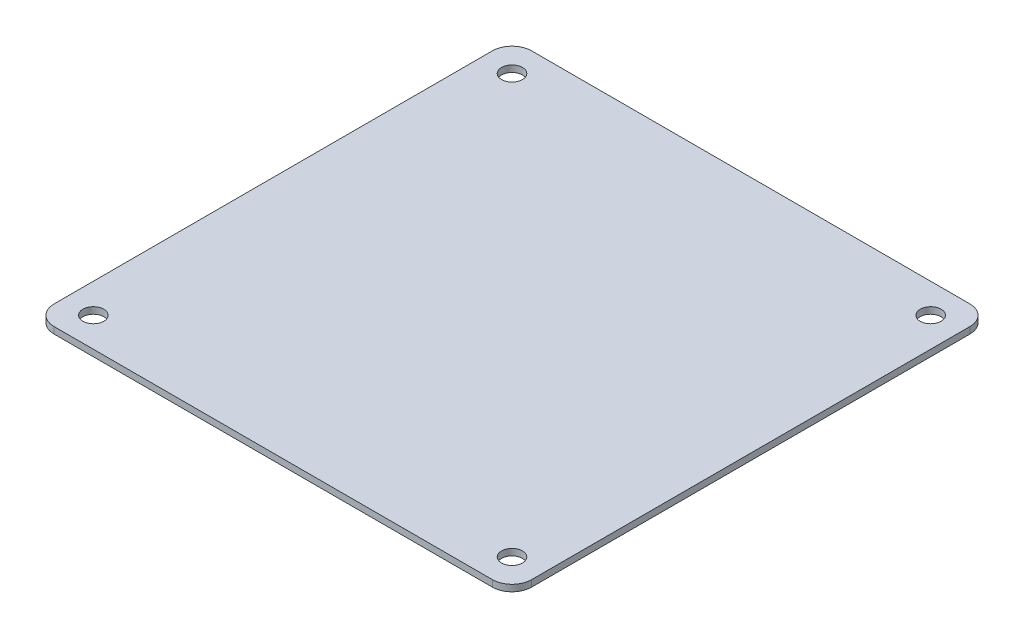
ISO-10303-21;
HEADER;
FILE_DESCRIPTION(('STEP AP214'),'2;1');
FILE_NAME('part.step','',(''),(''),'','','');
FILE_SCHEMA(('AUTOMOTIVE_DESIGN { 1 0 10303 214 1 1 1 1 }'));
ENDSEC;
DATA;
#1=APPLICATION_CONTEXT('core data for automotive mechanical design processes');
#2=APPLICATION_PROTOCOL_DEFINITION('international standard','automotive_design',2000,#1);
#3=PRODUCT_CONTEXT('',#1,'mechanical');
#4=PRODUCT('Part','Part','',(#3));
#5=PRODUCT_RELATED_PRODUCT_CATEGORY('part','',(#4));
#6=PRODUCT_DEFINITION_FORMATION('','',#4);
#7=PRODUCT_DEFINITION_CONTEXT('part definition',#1,'design');
#8=PRODUCT_DEFINITION('design','',#6,#7);
#9=PRODUCT_DEFINITION_SHAPE('','',#8);
#10=(LENGTH_UNIT() NAMED_UNIT(*) SI_UNIT(.MILLI.,.METRE.));
#11=(NAMED_UNIT(*) PLANE_ANGLE_UNIT() SI_UNIT($,.RADIAN.));
#12=(NAMED_UNIT(*) SI_UNIT($,.STERADIAN.) SOLID_ANGLE_UNIT());
#13=UNCERTAINTY_MEASURE_WITH_UNIT(LENGTH_MEASURE(1.E-05),#10,'distance_accuracy_value','');
#14=(GEOMETRIC_REPRESENTATION_CONTEXT(3) GLOBAL_UNCERTAINTY_ASSIGNED_CONTEXT((#13)) GLOBAL_UNIT_ASSIGNED_CONTEXT((#10,
#11,#12)) REPRESENTATION_CONTEXT('',''));
#15=CARTESIAN_POINT('',(0.,0.,0.));
#16=DIRECTION('',(0.,0.,1.));
#17=DIRECTION('',(1.,0.,0.));
#18=AXIS2_PLACEMENT_3D('',#15,#16,#17);
#19=CARTESIAN_POINT('',(0.,0.,0.));
#20=DIRECTION('',(0.,1.,0.));
#21=DIRECTION('',(0.,0.,1.));
#22=AXIS2_PLACEMENT_3D('',#19,#20,#21);
#23=PLANE('',#22);
#24=DIRECTION('',(-1.,0.,0.));
#25=VECTOR('',#24,1.);
#26=CARTESIAN_POINT('',(36.5,0.,-36.5));
#27=LINE('',#26,#25);
#28=CARTESIAN_POINT('',(-33.5,0.,-36.5));
#29=VERTEX_POINT('',#28);
#30=CARTESIAN_POINT('',(33.5,0.,-36.5));
#31=VERTEX_POINT('',#30);
#32=EDGE_CURVE('E116',#29,#31,#27,.F.);
#33=ORIENTED_EDGE('',*,*,#32,.F.);
#34=CARTESIAN_POINT('',(-33.5,0.,-33.5));
#35=DIRECTION('',(0.,1.,0.));
#36=DIRECTION('',(0.,0.,1.));
#37=AXIS2_PLACEMENT_3D('',#34,#35,#36);
#38=CIRCLE('',#37,3.);
#39=CARTESIAN_POINT('',(-36.5,0.,-33.5));
#40=VERTEX_POINT('',#39);
#41=EDGE_CURVE('E146',#40,#29,#38,.F.);
#42=ORIENTED_EDGE('',*,*,#41,.F.);
#43=DIRECTION('',(0.,0.,1.));
#44=VECTOR('',#43,1.);
#45=CARTESIAN_POINT('',(-36.5,0.,36.5));
#46=LINE('',#45,#44);
#47=CARTESIAN_POINT('',(-36.5,0.,33.5));
#48=VERTEX_POINT('',#47);
#49=EDGE_CURVE('E112',#48,#40,#46,.F.);
#50=ORIENTED_EDGE('',*,*,#49,.F.);
#51=CARTESIAN_POINT('',(-33.5,0.,33.5));
#52=DIRECTION('',(0.,1.,0.));
#53=DIRECTION('',(0.,0.,1.));
#54=AXIS2_PLACEMENT_3D('',#51,#52,#53);
#55=CIRCLE('',#54,3.);
#56=CARTESIAN_POINT('',(-33.5,0.,36.5));
#57=VERTEX_POINT('',#56);
#58=EDGE_CURVE('E144',#57,#48,#55,.F.);
#59=ORIENTED_EDGE('',*,*,#58,.F.);
#60=DIRECTION('',(1.,0.,0.));
#61=VECTOR('',#60,1.);
#62=CARTESIAN_POINT('',(36.5,0.,36.5));
#63=LINE('',#62,#61);
#64=CARTESIAN_POINT('',(33.5,0.,36.5));
#65=VERTEX_POINT('',#64);
#66=EDGE_CURVE('E95',#65,#57,#63,.F.);
#67=ORIENTED_EDGE('',*,*,#66,.F.);
#68=CARTESIAN_POINT('',(33.5,0.,33.5));
#69=DIRECTION('',(0.,1.,0.));
#70=DIRECTION('',(0.,0.,1.));
#71=AXIS2_PLACEMENT_3D('',#68,#69,#70);
#72=CIRCLE('',#71,3.);
#73=CARTESIAN_POINT('',(36.5,0.,33.5));
#74=VERTEX_POINT('',#73);
#75=EDGE_CURVE('E88',#74,#65,#72,.F.);
#76=ORIENTED_EDGE('',*,*,#75,.F.);
#77=DIRECTION('',(0.,0.,-1.));
#78=VECTOR('',#77,1.);
#79=CARTESIAN_POINT('',(36.5,0.,36.5));
#80=LINE('',#79,#78);
#81=CARTESIAN_POINT('',(36.5,0.,-33.5));
#82=VERTEX_POINT('',#81);
#83=EDGE_CURVE('E78',#82,#74,#80,.F.);
#84=ORIENTED_EDGE('',*,*,#83,.F.);
#85=CARTESIAN_POINT('',(33.5,0.,-33.5));
#86=DIRECTION('',(0.,1.,0.));
#87=DIRECTION('',(0.,0.,1.));
#88=AXIS2_PLACEMENT_3D('',#85,#86,#87);
#89=CIRCLE('',#88,3.);
#90=EDGE_CURVE('E104',#31,#82,#89,.F.);
#91=ORIENTED_EDGE('',*,*,#90,.F.);
#92=EDGE_LOOP('',(#33,#42,#50,#59,#67,#76,#84,#91));
#93=FACE_BOUND('',#92,.T.);
#94=CARTESIAN_POINT('',(32.,0.,32.));
#95=DIRECTION('',(0.,1.,0.));
#96=DIRECTION('',(0.,0.,1.));
#97=AXIS2_PLACEMENT_3D('',#94,#95,#96);
#98=CIRCLE('',#97,1.6);
#99=CARTESIAN_POINT('',(32.,0.,33.6));
#100=VERTEX_POINT('',#99);
#101=EDGE_CURVE('E99',#100,#100,#98,.F.);
#102=ORIENTED_EDGE('',*,*,#101,.T.);
#103=EDGE_LOOP('',(#102));
#104=FACE_BOUND('',#103,.T.);
#105=CARTESIAN_POINT('',(-32.,0.,-32.));
#106=DIRECTION('',(0.,1.,0.));
#107=DIRECTION('',(0.,0.,1.));
#108=AXIS2_PLACEMENT_3D('',#105,#106,#107);
#109=CIRCLE('',#108,1.6);
#110=CARTESIAN_POINT('',(-32.,0.,-30.4));
#111=VERTEX_POINT('',#110);
#112=EDGE_CURVE('E150',#111,#111,#109,.F.);
#113=ORIENTED_EDGE('',*,*,#112,.T.);
#114=EDGE_LOOP('',(#113));
#115=FACE_BOUND('',#114,.T.);
#116=CARTESIAN_POINT('',(32.,0.,-32.));
#117=DIRECTION('',(0.,1.,0.));
#118=DIRECTION('',(0.,0.,1.));
#119=AXIS2_PLACEMENT_3D('',#116,#117,#118);
#120=CIRCLE('',#119,1.6);
#121=CARTESIAN_POINT('',(32.,0.,-30.4));
#122=VERTEX_POINT('',#121);
#123=EDGE_CURVE('E152',#122,#122,#120,.F.);
#124=ORIENTED_EDGE('',*,*,#123,.T.);
#125=EDGE_LOOP('',(#124));
#126=FACE_BOUND('',#125,.T.);
#127=CARTESIAN_POINT('',(-32.,0.,32.));
#128=DIRECTION('',(0.,1.,0.));
#129=DIRECTION('',(0.,0.,1.));
#130=AXIS2_PLACEMENT_3D('',#127,#128,#129);
#131=CIRCLE('',#130,1.6);
#132=CARTESIAN_POINT('',(-32.,0.,33.6));
#133=VERTEX_POINT('',#132);
#134=EDGE_CURVE('E20',#133,#133,#131,.F.);
#135=ORIENTED_EDGE('',*,*,#134,.T.);
#136=EDGE_LOOP('',(#135));
#137=FACE_BOUND('',#136,.T.);
#138=ADVANCED_FACE('F17',(#93,#104,#115,#126,#137),#23,.T.);
#139=CARTESIAN_POINT('',(-32.,-1.,32.));
#140=DIRECTION('',(0.,1.,0.));
#141=DIRECTION('',(0.,0.,1.));
#142=AXIS2_PLACEMENT_3D('',#139,#140,#141);
#143=CYLINDRICAL_SURFACE('',#142,1.6);
#144=CARTESIAN_POINT('',(-32.,-1.,32.));
#145=DIRECTION('',(0.,1.,0.));
#146=DIRECTION('',(0.,0.,1.));
#147=AXIS2_PLACEMENT_3D('',#144,#145,#146);
#148=CIRCLE('',#147,1.6);
#149=CARTESIAN_POINT('',(-32.,-1.,33.6));
#150=VERTEX_POINT('',#149);
#151=EDGE_CURVE('E140',#150,#150,#148,.F.);
#152=ORIENTED_EDGE('',*,*,#151,.T.);
#153=EDGE_LOOP('',(#152));
#154=FACE_BOUND('',#153,.T.);
#155=ORIENTED_EDGE('',*,*,#134,.F.);
#156=EDGE_LOOP('',(#155));
#157=FACE_BOUND('',#156,.T.);
#158=ADVANCED_FACE('F160',(#154,#157),#143,.F.);
#159=CARTESIAN_POINT('',(32.,-1.,-32.));
#160=DIRECTION('',(0.,1.,0.));
#161=DIRECTION('',(0.,0.,1.));
#162=AXIS2_PLACEMENT_3D('',#159,#160,#161);
#163=CYLINDRICAL_SURFACE('',#162,1.6);
#164=CARTESIAN_POINT('',(32.,-1.,-32.));
#165=DIRECTION('',(0.,1.,0.));
#166=DIRECTION('',(0.,0.,1.));
#167=AXIS2_PLACEMENT_3D('',#164,#165,#166);
#168=CIRCLE('',#167,1.6);
#169=CARTESIAN_POINT('',(32.,-1.,-30.4));
#170=VERTEX_POINT('',#169);
#171=EDGE_CURVE('E137',#170,#170,#168,.F.);
#172=ORIENTED_EDGE('',*,*,#171,.T.);
#173=EDGE_LOOP('',(#172));
#174=FACE_BOUND('',#173,.T.);
#175=ORIENTED_EDGE('',*,*,#123,.F.);
#176=EDGE_LOOP('',(#175));
#177=FACE_BOUND('',#176,.T.);
#178=ADVANCED_FACE('F162',(#174,#177),#163,.F.);
#179=CARTESIAN_POINT('',(-32.,-1.,-32.));
#180=DIRECTION('',(0.,1.,0.));
#181=DIRECTION('',(0.,0.,1.));
#182=AXIS2_PLACEMENT_3D('',#179,#180,#181);
#183=CYLINDRICAL_SURFACE('',#182,1.6);
#184=CARTESIAN_POINT('',(-32.,-1.,-32.));
#185=DIRECTION('',(0.,1.,0.));
#186=DIRECTION('',(0.,0.,1.));
#187=AXIS2_PLACEMENT_3D('',#184,#185,#186);
#188=CIRCLE('',#187,1.6);
#189=CARTESIAN_POINT('',(-32.,-1.,-30.4));
#190=VERTEX_POINT('',#189);
#191=EDGE_CURVE('E134',#190,#190,#188,.F.);
#192=ORIENTED_EDGE('',*,*,#191,.T.);
#193=EDGE_LOOP('',(#192));
#194=FACE_BOUND('',#193,.T.);
#195=ORIENTED_EDGE('',*,*,#112,.F.);
#196=EDGE_LOOP('',(#195));
#197=FACE_BOUND('',#196,.T.);
#198=ADVANCED_FACE('F169',(#194,#197),#183,.F.);
#199=CARTESIAN_POINT('',(32.,-1.,32.));
#200=DIRECTION('',(0.,1.,0.));
#201=DIRECTION('',(0.,0.,1.));
#202=AXIS2_PLACEMENT_3D('',#199,#200,#201);
#203=CYLINDRICAL_SURFACE('',#202,1.6);
#204=CARTESIAN_POINT('',(32.,-1.,32.));
#205=DIRECTION('',(0.,1.,0.));
#206=DIRECTION('',(0.,0.,1.));
#207=AXIS2_PLACEMENT_3D('',#204,#205,#206);
#208=CIRCLE('',#207,1.6);
#209=CARTESIAN_POINT('',(32.,-1.,33.6));
#210=VERTEX_POINT('',#209);
#211=EDGE_CURVE('E131',#210,#210,#208,.F.);
#212=ORIENTED_EDGE('',*,*,#211,.T.);
#213=EDGE_LOOP('',(#212));
#214=FACE_BOUND('',#213,.T.);
#215=ORIENTED_EDGE('',*,*,#101,.F.);
#216=EDGE_LOOP('',(#215));
#217=FACE_BOUND('',#216,.T.);
#218=ADVANCED_FACE('F208',(#214,#217),#203,.F.);
#219=CARTESIAN_POINT('',(33.5,-1.,33.5));
#220=DIRECTION('',(0.,1.,0.));
#221=DIRECTION('',(0.,0.,1.));
#222=AXIS2_PLACEMENT_3D('',#219,#220,#221);
#223=CYLINDRICAL_SURFACE('',#222,3.);
#224=ORIENTED_EDGE('',*,*,#75,.T.);
#225=DIRECTION('',(0.,1.,0.));
#226=VECTOR('',#225,1.);
#227=CARTESIAN_POINT('',(33.5,-1.,36.5));
#228=LINE('',#227,#226);
#229=CARTESIAN_POINT('',(33.5,-1.,36.5));
#230=VERTEX_POINT('',#229);
#231=EDGE_CURVE('E143',#230,#65,#228,.T.);
#232=ORIENTED_EDGE('',*,*,#231,.F.);
#233=CARTESIAN_POINT('',(33.5,-1.,33.5));
#234=DIRECTION('',(0.,1.,0.));
#235=DIRECTION('',(0.,0.,1.));
#236=AXIS2_PLACEMENT_3D('',#233,#234,#235);
#237=CIRCLE('',#236,3.);
#238=CARTESIAN_POINT('',(36.5,-1.,33.5));
#239=VERTEX_POINT('',#238);
#240=EDGE_CURVE('E103',#230,#239,#237,.T.);
#241=ORIENTED_EDGE('',*,*,#240,.T.);
#242=DIRECTION('',(0.,1.,0.));
#243=VECTOR('',#242,1.);
#244=CARTESIAN_POINT('',(36.5,-1.,33.5));
#245=LINE('',#244,#243);
#246=EDGE_CURVE('E83',#74,#239,#245,.F.);
#247=ORIENTED_EDGE('',*,*,#246,.F.);
#248=EDGE_LOOP('',(#224,#232,#241,#247));
#249=FACE_BOUND('',#248,.T.);
#250=ADVANCED_FACE('F102',(#249),#223,.T.);
#251=CARTESIAN_POINT('',(36.5,-1.,36.5));
#252=DIRECTION('',(1.,0.,0.));
#253=DIRECTION('',(0.,0.,-1.));
#254=AXIS2_PLACEMENT_3D('',#251,#252,#253);
#255=PLANE('',#254);
#256=ORIENTED_EDGE('',*,*,#83,.T.);
#257=ORIENTED_EDGE('',*,*,#246,.T.);
#258=DIRECTION('',(0.,0.,1.));
#259=VECTOR('',#258,1.);
#260=CARTESIAN_POINT('',(36.5,-1.,0.));
#261=LINE('',#260,#259);
#262=CARTESIAN_POINT('',(36.5,-1.,-33.5));
#263=VERTEX_POINT('',#262);
#264=EDGE_CURVE('E129',#239,#263,#261,.F.);
#265=ORIENTED_EDGE('',*,*,#264,.T.);
#266=DIRECTION('',(0.,1.,0.));
#267=VECTOR('',#266,1.);
#268=CARTESIAN_POINT('',(36.5,-1.,-33.5));
#269=LINE('',#268,#267);
#270=EDGE_CURVE('E85',#82,#263,#269,.F.);
#271=ORIENTED_EDGE('',*,*,#270,.F.);
#272=EDGE_LOOP('',(#256,#257,#265,#271));
#273=FACE_BOUND('',#272,.T.);
#274=ADVANCED_FACE('F80',(#273),#255,.T.);
#275=CARTESIAN_POINT('',(33.5,-1.,-33.5));
#276=DIRECTION('',(0.,1.,0.));
#277=DIRECTION('',(0.,0.,1.));
#278=AXIS2_PLACEMENT_3D('',#275,#276,#277);
#279=CYLINDRICAL_SURFACE('',#278,3.);
#280=ORIENTED_EDGE('',*,*,#90,.T.);
#281=ORIENTED_EDGE('',*,*,#270,.T.);
#282=CARTESIAN_POINT('',(33.5,-1.,-33.5));
#283=DIRECTION('',(0.,1.,0.));
#284=DIRECTION('',(0.,0.,1.));
#285=AXIS2_PLACEMENT_3D('',#282,#283,#284);
#286=CIRCLE('',#285,3.);
#287=CARTESIAN_POINT('',(33.5,-1.,-36.5));
#288=VERTEX_POINT('',#287);
#289=EDGE_CURVE('E126',#263,#288,#286,.T.);
#290=ORIENTED_EDGE('',*,*,#289,.T.);
#291=DIRECTION('',(0.,1.,0.));
#292=VECTOR('',#291,1.);
#293=CARTESIAN_POINT('',(33.5,-1.,-36.5));
#294=LINE('',#293,#292);
#295=EDGE_CURVE('E117',#31,#288,#294,.F.);
#296=ORIENTED_EDGE('',*,*,#295,.F.);
#297=EDGE_LOOP('',(#280,#281,#290,#296));
#298=FACE_BOUND('',#297,.T.);
#299=ADVANCED_FACE('F199',(#298),#279,.T.);
#300=CARTESIAN_POINT('',(36.5,-1.,-36.5));
#301=DIRECTION('',(0.,0.,-1.));
#302=DIRECTION('',(-1.,0.,0.));
#303=AXIS2_PLACEMENT_3D('',#300,#301,#302);
#304=PLANE('',#303);
#305=ORIENTED_EDGE('',*,*,#32,.T.);
#306=ORIENTED_EDGE('',*,*,#295,.T.);
#307=DIRECTION('',(1.,0.,0.));
#308=VECTOR('',#307,1.);
#309=CARTESIAN_POINT('',(0.,-1.,-36.5));
#310=LINE('',#309,#308);
#311=CARTESIAN_POINT('',(-33.5,-1.,-36.5));
#312=VERTEX_POINT('',#311);
#313=EDGE_CURVE('E125',#288,#312,#310,.F.);
#314=ORIENTED_EDGE('',*,*,#313,.T.);
#315=DIRECTION('',(0.,1.,0.));
#316=VECTOR('',#315,1.);
#317=CARTESIAN_POINT('',(-33.5,-1.,-36.5));
#318=LINE('',#317,#316);
#319=EDGE_CURVE('E115',#29,#312,#318,.F.);
#320=ORIENTED_EDGE('',*,*,#319,.F.);
#321=EDGE_LOOP('',(#305,#306,#314,#320));
#322=FACE_BOUND('',#321,.T.);
#323=ADVANCED_FACE('F195',(#322),#304,.T.);
#324=CARTESIAN_POINT('',(-33.5,-1.,-33.5));
#325=DIRECTION('',(0.,1.,0.));
#326=DIRECTION('',(0.,0.,1.));
#327=AXIS2_PLACEMENT_3D('',#324,#325,#326);
#328=CYLINDRICAL_SURFACE('',#327,3.);
#329=ORIENTED_EDGE('',*,*,#41,.T.);
#330=ORIENTED_EDGE('',*,*,#319,.T.);
#331=CARTESIAN_POINT('',(-33.5,-1.,-33.5));
#332=DIRECTION('',(0.,1.,0.));
#333=DIRECTION('',(0.,0.,1.));
#334=AXIS2_PLACEMENT_3D('',#331,#332,#333);
#335=CIRCLE('',#334,3.);
#336=CARTESIAN_POINT('',(-36.5,-1.,-33.5));
#337=VERTEX_POINT('',#336);
#338=EDGE_CURVE('E122',#312,#337,#335,.T.);
#339=ORIENTED_EDGE('',*,*,#338,.T.);
#340=DIRECTION('',(0.,1.,0.));
#341=VECTOR('',#340,1.);
#342=CARTESIAN_POINT('',(-36.5,-1.,-33.5));
#343=LINE('',#342,#341);
#344=EDGE_CURVE('E114',#40,#337,#343,.F.);
#345=ORIENTED_EDGE('',*,*,#344,.F.);
#346=EDGE_LOOP('',(#329,#330,#339,#345));
#347=FACE_BOUND('',#346,.T.);
#348=ADVANCED_FACE('F191',(#347),#328,.T.);
#349=CARTESIAN_POINT('',(-36.5,-1.,36.5));
#350=DIRECTION('',(-1.,0.,0.));
#351=DIRECTION('',(0.,0.,1.));
#352=AXIS2_PLACEMENT_3D('',#349,#350,#351);
#353=PLANE('',#352);
#354=ORIENTED_EDGE('',*,*,#49,.T.);
#355=ORIENTED_EDGE('',*,*,#344,.T.);
#356=DIRECTION('',(0.,0.,1.));
#357=VECTOR('',#356,1.);
#358=CARTESIAN_POINT('',(-36.5,-1.,0.));
#359=LINE('',#358,#357);
#360=CARTESIAN_POINT('',(-36.5,-1.,33.5));
#361=VERTEX_POINT('',#360);
#362=EDGE_CURVE('E121',#337,#361,#359,.T.);
#363=ORIENTED_EDGE('',*,*,#362,.T.);
#364=DIRECTION('',(0.,1.,0.));
#365=VECTOR('',#364,1.);
#366=CARTESIAN_POINT('',(-36.5,-1.,33.5));
#367=LINE('',#366,#365);
#368=EDGE_CURVE('E111',#48,#361,#367,.F.);
#369=ORIENTED_EDGE('',*,*,#368,.F.);
#370=EDGE_LOOP('',(#354,#355,#363,#369));
#371=FACE_BOUND('',#370,.T.);
#372=ADVANCED_FACE('F187',(#371),#353,.T.);
#373=CARTESIAN_POINT('',(-33.5,-1.,33.5));
#374=DIRECTION('',(0.,1.,0.));
#375=DIRECTION('',(0.,0.,1.));
#376=AXIS2_PLACEMENT_3D('',#373,#374,#375);
#377=CYLINDRICAL_SURFACE('',#376,3.);
#378=ORIENTED_EDGE('',*,*,#58,.T.);
#379=ORIENTED_EDGE('',*,*,#368,.T.);
#380=CARTESIAN_POINT('',(-33.5,-1.,33.5));
#381=DIRECTION('',(0.,1.,0.));
#382=DIRECTION('',(0.,0.,1.));
#383=AXIS2_PLACEMENT_3D('',#380,#381,#382);
#384=CIRCLE('',#383,3.);
#385=CARTESIAN_POINT('',(-33.5,-1.,36.5));
#386=VERTEX_POINT('',#385);
#387=EDGE_CURVE('E26',#361,#386,#384,.T.);
#388=ORIENTED_EDGE('',*,*,#387,.T.);
#389=DIRECTION('',(0.,1.,0.));
#390=VECTOR('',#389,1.);
#391=CARTESIAN_POINT('',(-33.5,-1.,36.5));
#392=LINE('',#391,#390);
#393=EDGE_CURVE('E34',#57,#386,#392,.F.);
#394=ORIENTED_EDGE('',*,*,#393,.F.);
#395=EDGE_LOOP('',(#378,#379,#388,#394));
#396=FACE_BOUND('',#395,.T.);
#397=ADVANCED_FACE('F180',(#396),#377,.T.);
#398=CARTESIAN_POINT('',(36.5,-1.,36.5));
#399=DIRECTION('',(0.,0.,1.));
#400=DIRECTION('',(1.,0.,0.));
#401=AXIS2_PLACEMENT_3D('',#398,#399,#400);
#402=PLANE('',#401);
#403=DIRECTION('',(1.,0.,0.));
#404=VECTOR('',#403,1.);
#405=CARTESIAN_POINT('',(0.,-1.,36.5));
#406=LINE('',#405,#404);
#407=EDGE_CURVE('E10',#386,#230,#406,.T.);
#408=ORIENTED_EDGE('',*,*,#407,.T.);
#409=ORIENTED_EDGE('',*,*,#231,.T.);
#410=ORIENTED_EDGE('',*,*,#66,.T.);
#411=ORIENTED_EDGE('',*,*,#393,.T.);
#412=EDGE_LOOP('',(#408,#409,#410,#411));
#413=FACE_BOUND('',#412,.T.);
#414=ADVANCED_FACE('F174',(#413),#402,.T.);
#415=CARTESIAN_POINT('',(0.,-1.,0.));
#416=DIRECTION('',(0.,1.,0.));
#417=DIRECTION('',(0.,0.,1.));
#418=AXIS2_PLACEMENT_3D('',#415,#416,#417);
#419=PLANE('',#418);
#420=ORIENTED_EDGE('',*,*,#387,.F.);
#421=ORIENTED_EDGE('',*,*,#362,.F.);
#422=ORIENTED_EDGE('',*,*,#338,.F.);
#423=ORIENTED_EDGE('',*,*,#313,.F.);
#424=ORIENTED_EDGE('',*,*,#289,.F.);
#425=ORIENTED_EDGE('',*,*,#264,.F.);
#426=ORIENTED_EDGE('',*,*,#240,.F.);
#427=ORIENTED_EDGE('',*,*,#407,.F.);
#428=EDGE_LOOP('',(#420,#421,#422,#423,#424,#425,#426,#427));
#429=FACE_BOUND('',#428,.T.);
#430=ORIENTED_EDGE('',*,*,#211,.F.);
#431=EDGE_LOOP('',(#430));
#432=FACE_BOUND('',#431,.T.);
#433=ORIENTED_EDGE('',*,*,#191,.F.);
#434=EDGE_LOOP('',(#433));
#435=FACE_BOUND('',#434,.T.);
#436=ORIENTED_EDGE('',*,*,#171,.F.);
#437=EDGE_LOOP('',(#436));
#438=FACE_BOUND('',#437,.T.);
#439=ORIENTED_EDGE('',*,*,#151,.F.);
#440=EDGE_LOOP('',(#439));
#441=FACE_BOUND('',#440,.T.);
#442=ADVANCED_FACE('F172',(#429,#432,#435,#438,#441),#419,.F.);
#443=CLOSED_SHELL('',(#138,#158,#178,#198,#218,#250,#274,#299,#323,#348,#372,#397,#414,#442));
#444=MANIFOLD_SOLID_BREP('B1',#443);
#445=ADVANCED_BREP_SHAPE_REPRESENTATION('',(#18,#444),#14);
#446=SHAPE_DEFINITION_REPRESENTATION(#9,#445);
ENDSEC;
END-ISO-10303-21;
